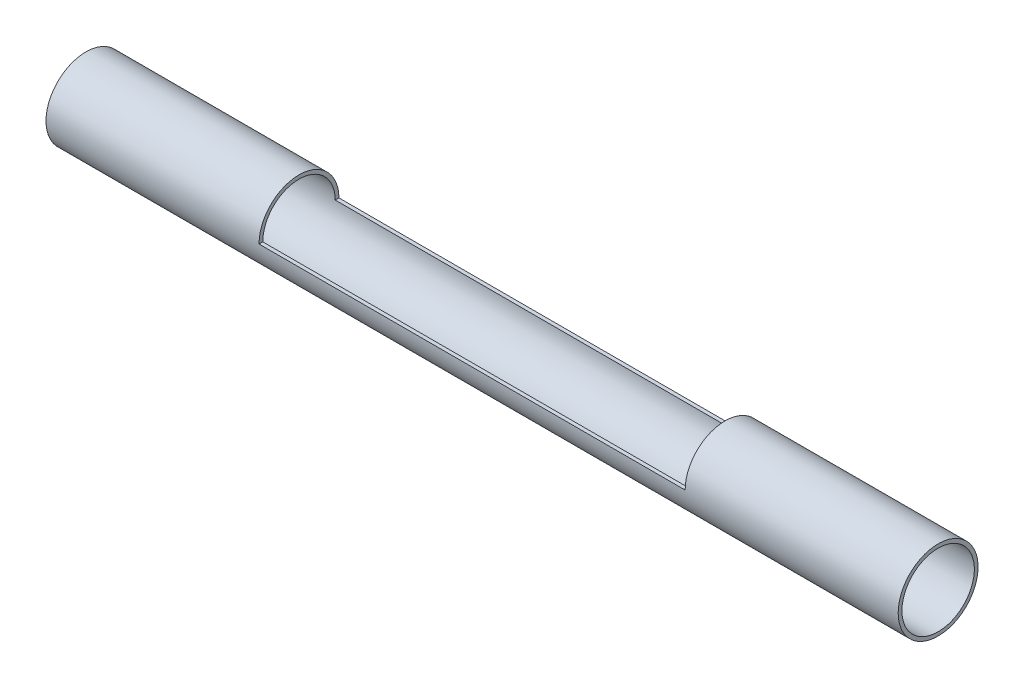
ISO-10303-21;
HEADER;
FILE_DESCRIPTION(('STEP AP214'),'2;1');
FILE_NAME('part.step','',(''),(''),'','','');
FILE_SCHEMA(('AUTOMOTIVE_DESIGN { 1 0 10303 214 1 1 1 1 }'));
ENDSEC;
DATA;
#1=APPLICATION_CONTEXT('core data for automotive mechanical design processes');
#2=APPLICATION_PROTOCOL_DEFINITION('international standard','automotive_design',2000,#1);
#3=PRODUCT_CONTEXT('',#1,'mechanical');
#4=PRODUCT('Part','Part','',(#3));
#5=PRODUCT_RELATED_PRODUCT_CATEGORY('part','',(#4));
#6=PRODUCT_DEFINITION_FORMATION('','',#4);
#7=PRODUCT_DEFINITION_CONTEXT('part definition',#1,'design');
#8=PRODUCT_DEFINITION('design','',#6,#7);
#9=PRODUCT_DEFINITION_SHAPE('','',#8);
#10=(LENGTH_UNIT() NAMED_UNIT(*) SI_UNIT(.MILLI.,.METRE.));
#11=(NAMED_UNIT(*) PLANE_ANGLE_UNIT() SI_UNIT($,.RADIAN.));
#12=(NAMED_UNIT(*) SI_UNIT($,.STERADIAN.) SOLID_ANGLE_UNIT());
#13=UNCERTAINTY_MEASURE_WITH_UNIT(LENGTH_MEASURE(1.E-05),#10,'distance_accuracy_value','');
#14=(GEOMETRIC_REPRESENTATION_CONTEXT(3) GLOBAL_UNCERTAINTY_ASSIGNED_CONTEXT((#13)) GLOBAL_UNIT_ASSIGNED_CONTEXT((#10,
#11,#12)) REPRESENTATION_CONTEXT('',''));
#15=CARTESIAN_POINT('',(0.,0.,0.));
#16=DIRECTION('',(0.,0.,1.));
#17=DIRECTION('',(1.,0.,0.));
#18=AXIS2_PLACEMENT_3D('',#15,#16,#17);
#19=CARTESIAN_POINT('',(0.,0.,0.));
#20=DIRECTION('',(-1.,0.,0.));
#21=DIRECTION('',(0.,0.,1.));
#22=AXIS2_PLACEMENT_3D('',#19,#20,#21);
#23=CYLINDRICAL_SURFACE('',#22,9.525);
#24=CARTESIAN_POINT('',(203.2,0.,0.));
#25=DIRECTION('',(-1.,0.,0.));
#26=DIRECTION('',(0.,0.,1.));
#27=AXIS2_PLACEMENT_3D('',#24,#25,#26);
#28=CIRCLE('',#27,9.525);
#29=CARTESIAN_POINT('',(203.2,0.,9.525));
#30=VERTEX_POINT('',#29);
#31=EDGE_CURVE('E103',#30,#30,#28,.T.);
#32=ORIENTED_EDGE('',*,*,#31,.T.);
#33=EDGE_LOOP('',(#32));
#34=FACE_BOUND('',#33,.T.);
#35=CARTESIAN_POINT('',(0.,0.,0.));
#36=DIRECTION('',(-1.,0.,0.));
#37=DIRECTION('',(0.,0.,1.));
#38=AXIS2_PLACEMENT_3D('',#35,#36,#37);
#39=CIRCLE('',#38,9.525);
#40=CARTESIAN_POINT('',(0.,0.,9.525));
#41=VERTEX_POINT('',#40);
#42=EDGE_CURVE('E106',#41,#41,#39,.T.);
#43=ORIENTED_EDGE('',*,*,#42,.F.);
#44=EDGE_LOOP('',(#43));
#45=FACE_BOUND('',#44,.T.);
#46=DIRECTION('',(1.,0.,0.));
#47=VECTOR('',#46,1.);
#48=CARTESIAN_POINT('',(50.8,0.,-9.525));
#49=LINE('',#48,#47);
#50=CARTESIAN_POINT('',(50.8,0.,-9.525));
#51=VERTEX_POINT('',#50);
#52=CARTESIAN_POINT('',(152.4,0.,-9.525));
#53=VERTEX_POINT('',#52);
#54=EDGE_CURVE('E89',#51,#53,#49,.T.);
#55=ORIENTED_EDGE('',*,*,#54,.T.);
#56=CARTESIAN_POINT('',(152.4,0.,0.));
#57=DIRECTION('',(1.,0.,0.));
#58=DIRECTION('',(0.,0.,-1.));
#59=AXIS2_PLACEMENT_3D('',#56,#57,#58);
#60=CIRCLE('',#59,9.525);
#61=CARTESIAN_POINT('',(152.4,0.,9.525));
#62=VERTEX_POINT('',#61);
#63=EDGE_CURVE('E78',#53,#62,#60,.T.);
#64=ORIENTED_EDGE('',*,*,#63,.T.);
#65=DIRECTION('',(1.,0.,0.));
#66=VECTOR('',#65,1.);
#67=CARTESIAN_POINT('',(50.8,0.,9.525));
#68=LINE('',#67,#66);
#69=CARTESIAN_POINT('',(50.8,0.,9.525));
#70=VERTEX_POINT('',#69);
#71=EDGE_CURVE('E85',#70,#62,#68,.T.);
#72=ORIENTED_EDGE('',*,*,#71,.F.);
#73=CARTESIAN_POINT('',(50.8,0.,0.));
#74=DIRECTION('',(-1.,0.,0.));
#75=DIRECTION('',(0.,0.,1.));
#76=AXIS2_PLACEMENT_3D('',#73,#74,#75);
#77=CIRCLE('',#76,9.525);
#78=EDGE_CURVE('E92',#70,#51,#77,.T.);
#79=ORIENTED_EDGE('',*,*,#78,.T.);
#80=EDGE_LOOP('',(#55,#64,#72,#79));
#81=FACE_BOUND('',#80,.T.);
#82=ADVANCED_FACE('F33',(#34,#45,#81),#23,.T.);
#83=CARTESIAN_POINT('',(0.,0.,-8.63599999999998));
#84=DIRECTION('',(1.,0.,0.));
#85=DIRECTION('',(0.,0.,-1.));
#86=AXIS2_PLACEMENT_3D('',#83,#84,#85);
#87=PLANE('',#86);
#88=CARTESIAN_POINT('',(0.,0.,0.));
#89=DIRECTION('',(-1.,0.,0.));
#90=DIRECTION('',(0.,0.,1.));
#91=AXIS2_PLACEMENT_3D('',#88,#89,#90);
#92=CIRCLE('',#91,8.63599999999998);
#93=CARTESIAN_POINT('',(0.,0.,8.63599999999998));
#94=VERTEX_POINT('',#93);
#95=EDGE_CURVE('E94',#94,#94,#92,.T.);
#96=ORIENTED_EDGE('',*,*,#95,.F.);
#97=EDGE_LOOP('',(#96));
#98=FACE_BOUND('',#97,.T.);
#99=ORIENTED_EDGE('',*,*,#42,.T.);
#100=EDGE_LOOP('',(#99));
#101=FACE_BOUND('',#100,.T.);
#102=ADVANCED_FACE('F35',(#98,#101),#87,.F.);
#103=CARTESIAN_POINT('',(203.2,0.,-9.525));
#104=DIRECTION('',(-1.,0.,0.));
#105=DIRECTION('',(0.,0.,1.));
#106=AXIS2_PLACEMENT_3D('',#103,#104,#105);
#107=PLANE('',#106);
#108=ORIENTED_EDGE('',*,*,#31,.F.);
#109=EDGE_LOOP('',(#108));
#110=FACE_BOUND('',#109,.T.);
#111=CARTESIAN_POINT('',(203.2,0.,0.));
#112=DIRECTION('',(-1.,0.,0.));
#113=DIRECTION('',(0.,0.,1.));
#114=AXIS2_PLACEMENT_3D('',#111,#112,#113);
#115=CIRCLE('',#114,8.636);
#116=CARTESIAN_POINT('',(203.2,0.,8.636));
#117=VERTEX_POINT('',#116);
#118=EDGE_CURVE('E100',#117,#117,#115,.T.);
#119=ORIENTED_EDGE('',*,*,#118,.T.);
#120=EDGE_LOOP('',(#119));
#121=FACE_BOUND('',#120,.T.);
#122=ADVANCED_FACE('F132',(#110,#121),#107,.F.);
#123=CARTESIAN_POINT('',(0.,0.,0.));
#124=DIRECTION('',(-1.,0.,0.));
#125=DIRECTION('',(0.,0.,1.));
#126=AXIS2_PLACEMENT_3D('',#123,#124,#125);
#127=CYLINDRICAL_SURFACE('',#126,8.63599999999999);
#128=CARTESIAN_POINT('',(50.8,0.,0.));
#129=DIRECTION('',(-1.,0.,0.));
#130=DIRECTION('',(0.,0.,1.));
#131=AXIS2_PLACEMENT_3D('',#128,#129,#130);
#132=CIRCLE('',#131,8.63599999999999);
#133=CARTESIAN_POINT('',(50.8,0.,-8.63599999999999));
#134=VERTEX_POINT('',#133);
#135=CARTESIAN_POINT('',(50.8,0.,8.63599999999998));
#136=VERTEX_POINT('',#135);
#137=EDGE_CURVE('E41',#134,#136,#132,.F.);
#138=ORIENTED_EDGE('',*,*,#137,.T.);
#139=DIRECTION('',(-1.,0.,0.));
#140=VECTOR('',#139,1.);
#141=CARTESIAN_POINT('',(0.,0.,8.63599999999999));
#142=LINE('',#141,#140);
#143=CARTESIAN_POINT('',(152.4,0.,8.63599999999998));
#144=VERTEX_POINT('',#143);
#145=EDGE_CURVE('E11',#136,#144,#142,.F.);
#146=ORIENTED_EDGE('',*,*,#145,.T.);
#147=CARTESIAN_POINT('',(152.4,0.,0.));
#148=DIRECTION('',(1.,0.,0.));
#149=DIRECTION('',(0.,0.,-1.));
#150=AXIS2_PLACEMENT_3D('',#147,#148,#149);
#151=CIRCLE('',#150,8.63599999999999);
#152=CARTESIAN_POINT('',(152.4,0.,-8.63599999999999));
#153=VERTEX_POINT('',#152);
#154=EDGE_CURVE('E81',#144,#153,#151,.F.);
#155=ORIENTED_EDGE('',*,*,#154,.T.);
#156=DIRECTION('',(-1.,0.,0.));
#157=VECTOR('',#156,1.);
#158=CARTESIAN_POINT('',(0.,0.,-8.63599999999999));
#159=LINE('',#158,#157);
#160=EDGE_CURVE('E109',#153,#134,#159,.T.);
#161=ORIENTED_EDGE('',*,*,#160,.T.);
#162=EDGE_LOOP('',(#138,#146,#155,#161));
#163=FACE_BOUND('',#162,.T.);
#164=ORIENTED_EDGE('',*,*,#118,.F.);
#165=EDGE_LOOP('',(#164));
#166=FACE_BOUND('',#165,.T.);
#167=ORIENTED_EDGE('',*,*,#95,.T.);
#168=EDGE_LOOP('',(#167));
#169=FACE_BOUND('',#168,.T.);
#170=ADVANCED_FACE('F114',(#163,#166,#169),#127,.F.);
#171=CARTESIAN_POINT('',(50.8,16.7213705044854,-9.525));
#172=DIRECTION('',(-1.,0.,0.));
#173=DIRECTION('',(0.,0.,1.));
#174=AXIS2_PLACEMENT_3D('',#171,#172,#173);
#175=PLANE('',#174);
#176=DIRECTION('',(0.,0.,1.));
#177=VECTOR('',#176,1.);
#178=CARTESIAN_POINT('',(50.8,0.,-9.525));
#179=LINE('',#178,#177);
#180=EDGE_CURVE('E48',#136,#70,#179,.T.);
#181=ORIENTED_EDGE('',*,*,#180,.F.);
#182=ORIENTED_EDGE('',*,*,#137,.F.);
#183=EDGE_CURVE('E56',#51,#134,#179,.T.);
#184=ORIENTED_EDGE('',*,*,#183,.F.);
#185=ORIENTED_EDGE('',*,*,#78,.F.);
#186=EDGE_LOOP('',(#181,#182,#184,#185));
#187=FACE_BOUND('',#186,.T.);
#188=ADVANCED_FACE('F117',(#187),#175,.F.);
#189=CARTESIAN_POINT('',(152.4,16.7213705044854,-9.525));
#190=DIRECTION('',(1.,0.,0.));
#191=DIRECTION('',(0.,0.,-1.));
#192=AXIS2_PLACEMENT_3D('',#189,#190,#191);
#193=PLANE('',#192);
#194=DIRECTION('',(0.,0.,1.));
#195=VECTOR('',#194,1.);
#196=CARTESIAN_POINT('',(152.4,0.,-9.525));
#197=LINE('',#196,#195);
#198=EDGE_CURVE('E82',#53,#153,#197,.T.);
#199=ORIENTED_EDGE('',*,*,#198,.T.);
#200=ORIENTED_EDGE('',*,*,#154,.F.);
#201=EDGE_CURVE('E74',#144,#62,#197,.T.);
#202=ORIENTED_EDGE('',*,*,#201,.T.);
#203=ORIENTED_EDGE('',*,*,#63,.F.);
#204=EDGE_LOOP('',(#199,#200,#202,#203));
#205=FACE_BOUND('',#204,.T.);
#206=ADVANCED_FACE('F76',(#205),#193,.F.);
#207=CARTESIAN_POINT('',(50.8,0.,-9.525));
#208=DIRECTION('',(0.,-1.,0.));
#209=DIRECTION('',(0.,0.,-1.));
#210=AXIS2_PLACEMENT_3D('',#207,#208,#209);
#211=PLANE('',#210);
#212=ORIENTED_EDGE('',*,*,#180,.T.);
#213=ORIENTED_EDGE('',*,*,#71,.T.);
#214=ORIENTED_EDGE('',*,*,#201,.F.);
#215=ORIENTED_EDGE('',*,*,#145,.F.);
#216=EDGE_LOOP('',(#212,#213,#214,#215));
#217=FACE_BOUND('',#216,.T.);
#218=ADVANCED_FACE('F86',(#217),#211,.F.);
#219=ORIENTED_EDGE('',*,*,#198,.F.);
#220=ORIENTED_EDGE('',*,*,#54,.F.);
#221=ORIENTED_EDGE('',*,*,#183,.T.);
#222=ORIENTED_EDGE('',*,*,#160,.F.);
#223=EDGE_LOOP('',(#219,#220,#221,#222));
#224=FACE_BOUND('',#223,.T.);
#225=ADVANCED_FACE('F119',(#224),#211,.F.);
#226=CLOSED_SHELL('',(#82,#102,#122,#170,#188,#206,#218,#225));
#227=MANIFOLD_SOLID_BREP('B2',#226);
#228=ADVANCED_BREP_SHAPE_REPRESENTATION('',(#18,#227),#14);
#229=SHAPE_DEFINITION_REPRESENTATION(#9,#228);
ENDSEC;
END-ISO-10303-21;
